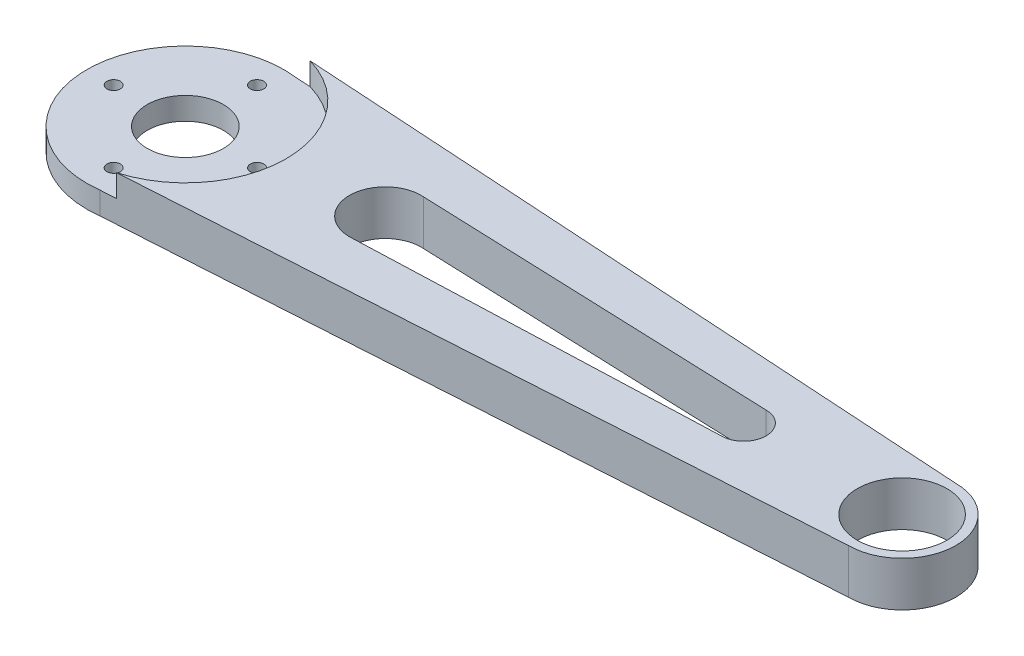
ISO-10303-21;
HEADER;
FILE_DESCRIPTION(('STEP AP214'),'2;1');
FILE_NAME('part.step','',(''),(''),'','','');
FILE_SCHEMA(('AUTOMOTIVE_DESIGN { 1 0 10303 214 1 1 1 1 }'));
ENDSEC;
DATA;
#1=APPLICATION_CONTEXT('core data for automotive mechanical design processes');
#2=APPLICATION_PROTOCOL_DEFINITION('international standard','automotive_design',2000,#1);
#3=PRODUCT_CONTEXT('',#1,'mechanical');
#4=PRODUCT('Part','Part','',(#3));
#5=PRODUCT_RELATED_PRODUCT_CATEGORY('part','',(#4));
#6=PRODUCT_DEFINITION_FORMATION('','',#4);
#7=PRODUCT_DEFINITION_CONTEXT('part definition',#1,'design');
#8=PRODUCT_DEFINITION('design','',#6,#7);
#9=PRODUCT_DEFINITION_SHAPE('','',#8);
#10=(LENGTH_UNIT() NAMED_UNIT(*) SI_UNIT(.MILLI.,.METRE.));
#11=(NAMED_UNIT(*) PLANE_ANGLE_UNIT() SI_UNIT($,.RADIAN.));
#12=(NAMED_UNIT(*) SI_UNIT($,.STERADIAN.) SOLID_ANGLE_UNIT());
#13=UNCERTAINTY_MEASURE_WITH_UNIT(LENGTH_MEASURE(1.E-05),#10,'distance_accuracy_value','');
#14=(GEOMETRIC_REPRESENTATION_CONTEXT(3) GLOBAL_UNCERTAINTY_ASSIGNED_CONTEXT((#13)) GLOBAL_UNIT_ASSIGNED_CONTEXT((#10,
#11,#12)) REPRESENTATION_CONTEXT('',''));
#15=CARTESIAN_POINT('',(0.,0.,0.));
#16=DIRECTION('',(0.,0.,1.));
#17=DIRECTION('',(1.,0.,0.));
#18=AXIS2_PLACEMENT_3D('',#15,#16,#17);
#19=CARTESIAN_POINT('',(-44.3187849693587,5.,0.));
#20=DIRECTION('',(0.,-1.,0.));
#21=DIRECTION('',(0.,0.,-1.));
#22=AXIS2_PLACEMENT_3D('',#19,#20,#21);
#23=CYLINDRICAL_SURFACE('',#22,11.);
#24=CARTESIAN_POINT('',(-44.3187849693587,2.5,0.));
#25=DIRECTION('',(0.,1.,0.));
#26=DIRECTION('',(0.,0.,1.));
#27=AXIS2_PLACEMENT_3D('',#24,#25,#26);
#28=CIRCLE('',#27,11.);
#29=CARTESIAN_POINT('',(-42.9491351639113,2.5,-10.9143968871595));
#30=VERTEX_POINT('',#29);
#31=CARTESIAN_POINT('',(-42.9491351639113,2.5,10.9143968871595));
#32=VERTEX_POINT('',#31);
#33=EDGE_CURVE('E150',#30,#32,#28,.T.);
#34=ORIENTED_EDGE('',*,*,#33,.F.);
#35=DIRECTION('',(0.,-1.,0.));
#36=VECTOR('',#35,1.);
#37=CARTESIAN_POINT('',(-42.9491351639113,5.,-10.9143968871595));
#38=LINE('',#37,#36);
#39=CARTESIAN_POINT('',(-42.9491351639113,0.,-10.9143968871595));
#40=VERTEX_POINT('',#39);
#41=EDGE_CURVE('E180',#40,#30,#38,.F.);
#42=ORIENTED_EDGE('',*,*,#41,.F.);
#43=CARTESIAN_POINT('',(-44.3187849693587,0.,0.));
#44=DIRECTION('',(0.,1.,0.));
#45=DIRECTION('',(0.,0.,1.));
#46=AXIS2_PLACEMENT_3D('',#43,#44,#45);
#47=CIRCLE('',#46,11.);
#48=CARTESIAN_POINT('',(-42.9491351639113,0.,10.9143968871595));
#49=VERTEX_POINT('',#48);
#50=EDGE_CURVE('E185',#40,#49,#47,.T.);
#51=ORIENTED_EDGE('',*,*,#50,.T.);
#52=DIRECTION('',(0.,-1.,0.));
#53=VECTOR('',#52,1.);
#54=CARTESIAN_POINT('',(-42.9491351639113,5.,10.9143968871595));
#55=LINE('',#54,#53);
#56=EDGE_CURVE('E183',#32,#49,#55,.T.);
#57=ORIENTED_EDGE('',*,*,#56,.F.);
#58=EDGE_LOOP('',(#34,#42,#51,#57));
#59=FACE_BOUND('',#58,.T.);
#60=ADVANCED_FACE('F37',(#59),#23,.T.);
#61=CARTESIAN_POINT('',(-44.3187849693587,5.,0.));
#62=DIRECTION('',(0.,1.,0.));
#63=DIRECTION('',(0.,0.,1.));
#64=AXIS2_PLACEMENT_3D('',#61,#62,#63);
#65=PLANE('',#64);
#66=DIRECTION('',(-0.999297615709181,0.,-0.0374736605890942));
#67=VECTOR('',#66,1.);
#68=CARTESIAN_POINT('',(-22.,5.,-4.));
#69=LINE('',#68,#67);
#70=CARTESIAN_POINT('',(18.,5.,-2.5));
#71=VERTEX_POINT('',#70);
#72=CARTESIAN_POINT('',(-21.7004212825714,5.,-3.98876579809643));
#73=VERTEX_POINT('',#72);
#74=EDGE_CURVE('E131',#71,#73,#69,.T.);
#75=ORIENTED_EDGE('',*,*,#74,.F.);
#76=CARTESIAN_POINT('',(18.,5.,0.));
#77=DIRECTION('',(0.,1.,0.));
#78=DIRECTION('',(0.,0.,1.));
#79=AXIS2_PLACEMENT_3D('',#76,#77,#78);
#80=CIRCLE('',#79,2.5);
#81=CARTESIAN_POINT('',(18.,5.,2.5));
#82=VERTEX_POINT('',#81);
#83=EDGE_CURVE('E135',#82,#71,#80,.T.);
#84=ORIENTED_EDGE('',*,*,#83,.F.);
#85=DIRECTION('',(0.999297615709181,0.,-0.0374736605890942));
#86=VECTOR('',#85,1.);
#87=CARTESIAN_POINT('',(18.,5.,2.5));
#88=LINE('',#87,#86);
#89=CARTESIAN_POINT('',(-21.7004212825714,5.,3.98876579809643));
#90=VERTEX_POINT('',#89);
#91=EDGE_CURVE('E115',#90,#82,#88,.T.);
#92=ORIENTED_EDGE('',*,*,#91,.F.);
#93=CARTESIAN_POINT('',(-22.,5.,0.));
#94=DIRECTION('',(0.,1.,0.));
#95=DIRECTION('',(0.,0.,1.));
#96=AXIS2_PLACEMENT_3D('',#93,#94,#95);
#97=CIRCLE('',#96,4.);
#98=EDGE_CURVE('E51',#73,#90,#97,.T.);
#99=ORIENTED_EDGE('',*,*,#98,.F.);
#100=EDGE_LOOP('',(#75,#84,#92,#99));
#101=FACE_BOUND('',#100,.T.);
#102=CARTESIAN_POINT('',(35.6812150306413,5.,0.));
#103=DIRECTION('',(0.,1.,0.));
#104=DIRECTION('',(0.,0.,1.));
#105=AXIS2_PLACEMENT_3D('',#102,#103,#104);
#106=CIRCLE('',#105,4.99999999999999);
#107=CARTESIAN_POINT('',(35.6812150306413,5.,4.99999999999999));
#108=VERTEX_POINT('',#107);
#109=EDGE_CURVE('E145',#108,#108,#106,.T.);
#110=ORIENTED_EDGE('',*,*,#109,.F.);
#111=EDGE_LOOP('',(#110));
#112=FACE_BOUND('',#111,.T.);
#113=CARTESIAN_POINT('',(-44.3187849693587,5.,0.));
#114=DIRECTION('',(0.,1.,0.));
#115=DIRECTION('',(0.,0.,1.));
#116=AXIS2_PLACEMENT_3D('',#113,#114,#115);
#117=CIRCLE('',#116,11.25);
#118=CARTESIAN_POINT('',(-41.1824623247394,5.,10.8039798347113));
#119=VERTEX_POINT('',#118);
#120=CARTESIAN_POINT('',(-41.1824623247394,5.,-10.8039798347113));
#121=VERTEX_POINT('',#120);
#122=EDGE_CURVE('E144',#119,#121,#117,.T.);
#123=ORIENTED_EDGE('',*,*,#122,.F.);
#124=DIRECTION('',(0.998052578482889,0.,-0.0623782861551804));
#125=VECTOR('',#124,1.);
#126=CARTESIAN_POINT('',(35.6812150306413,5.,6.));
#127=LINE('',#126,#125);
#128=CARTESIAN_POINT('',(35.6812150306413,5.,6.));
#129=VERTEX_POINT('',#128);
#130=EDGE_CURVE('E165',#119,#129,#127,.T.);
#131=ORIENTED_EDGE('',*,*,#130,.T.);
#132=CARTESIAN_POINT('',(35.6812150306413,5.,0.));
#133=DIRECTION('',(0.,1.,0.));
#134=DIRECTION('',(0.,0.,1.));
#135=AXIS2_PLACEMENT_3D('',#132,#133,#134);
#136=CIRCLE('',#135,6.);
#137=CARTESIAN_POINT('',(35.6812150306413,5.,-6.));
#138=VERTEX_POINT('',#137);
#139=EDGE_CURVE('E159',#129,#138,#136,.T.);
#140=ORIENTED_EDGE('',*,*,#139,.T.);
#141=DIRECTION('',(-0.998052578482889,0.,-0.0623782861551804));
#142=VECTOR('',#141,1.);
#143=CARTESIAN_POINT('',(-44.3187849693587,5.,-11.));
#144=LINE('',#143,#142);
#145=EDGE_CURVE('E167',#138,#121,#144,.T.);
#146=ORIENTED_EDGE('',*,*,#145,.T.);
#147=EDGE_LOOP('',(#123,#131,#140,#146));
#148=FACE_BOUND('',#147,.T.);
#149=ADVANCED_FACE('F195',(#101,#112,#148),#65,.T.);
#150=CARTESIAN_POINT('',(-44.3187849693587,0.,0.));
#151=DIRECTION('',(0.,1.,0.));
#152=DIRECTION('',(0.,0.,1.));
#153=AXIS2_PLACEMENT_3D('',#150,#151,#152);
#154=PLANE('',#153);
#155=CARTESIAN_POINT('',(-44.3187849693587,0.,0.));
#156=DIRECTION('',(0.,1.,0.));
#157=DIRECTION('',(0.,0.,1.));
#158=AXIS2_PLACEMENT_3D('',#155,#156,#157);
#159=CIRCLE('',#158,4.25000000000001);
#160=CARTESIAN_POINT('',(-44.3187849693587,0.,4.25000000000001));
#161=VERTEX_POINT('',#160);
#162=EDGE_CURVE('E277',#161,#161,#159,.T.);
#163=ORIENTED_EDGE('',*,*,#162,.T.);
#164=EDGE_LOOP('',(#163));
#165=FACE_BOUND('',#164,.T.);
#166=CARTESIAN_POINT('',(-44.3187849693587,0.,-8.));
#167=DIRECTION('',(0.,1.,0.));
#168=DIRECTION('',(0.,0.,1.));
#169=AXIS2_PLACEMENT_3D('',#166,#167,#168);
#170=CIRCLE('',#169,0.749999999999999);
#171=CARTESIAN_POINT('',(-44.3187849693587,0.,-7.25));
#172=VERTEX_POINT('',#171);
#173=EDGE_CURVE('E197',#172,#172,#170,.T.);
#174=ORIENTED_EDGE('',*,*,#173,.T.);
#175=EDGE_LOOP('',(#174));
#176=FACE_BOUND('',#175,.T.);
#177=CARTESIAN_POINT('',(-52.3187849693587,0.,0.));
#178=DIRECTION('',(0.,1.,0.));
#179=DIRECTION('',(0.,0.,1.));
#180=AXIS2_PLACEMENT_3D('',#177,#178,#179);
#181=CIRCLE('',#180,0.747737986683149);
#182=CARTESIAN_POINT('',(-52.3187849693587,0.,0.747737986683149));
#183=VERTEX_POINT('',#182);
#184=EDGE_CURVE('E283',#183,#183,#181,.T.);
#185=ORIENTED_EDGE('',*,*,#184,.T.);
#186=EDGE_LOOP('',(#185));
#187=FACE_BOUND('',#186,.T.);
#188=CARTESIAN_POINT('',(-44.3187849693587,0.,8.));
#189=DIRECTION('',(0.,1.,0.));
#190=DIRECTION('',(0.,0.,-1.));
#191=AXIS2_PLACEMENT_3D('',#188,#189,#190);
#192=CIRCLE('',#191,0.749999999999999);
#193=CARTESIAN_POINT('',(-44.3187849693587,0.,7.25));
#194=VERTEX_POINT('',#193);
#195=EDGE_CURVE('E287',#194,#194,#192,.T.);
#196=ORIENTED_EDGE('',*,*,#195,.T.);
#197=EDGE_LOOP('',(#196));
#198=FACE_BOUND('',#197,.T.);
#199=CARTESIAN_POINT('',(-36.3187849693587,0.,0.));
#200=DIRECTION('',(0.,1.,0.));
#201=DIRECTION('',(0.,0.,-1.));
#202=AXIS2_PLACEMENT_3D('',#199,#200,#201);
#203=CIRCLE('',#202,0.747737986683149);
#204=CARTESIAN_POINT('',(-36.3187849693587,0.,-0.747737986683149));
#205=VERTEX_POINT('',#204);
#206=EDGE_CURVE('E290',#205,#205,#203,.T.);
#207=ORIENTED_EDGE('',*,*,#206,.T.);
#208=EDGE_LOOP('',(#207));
#209=FACE_BOUND('',#208,.T.);
#210=CARTESIAN_POINT('',(18.,0.,0.));
#211=DIRECTION('',(0.,1.,0.));
#212=DIRECTION('',(0.,0.,1.));
#213=AXIS2_PLACEMENT_3D('',#210,#211,#212);
#214=CIRCLE('',#213,2.5);
#215=CARTESIAN_POINT('',(18.,0.,2.5));
#216=VERTEX_POINT('',#215);
#217=CARTESIAN_POINT('',(18.,0.,-2.5));
#218=VERTEX_POINT('',#217);
#219=EDGE_CURVE('E129',#216,#218,#214,.T.);
#220=ORIENTED_EDGE('',*,*,#219,.T.);
#221=DIRECTION('',(-0.999297615709181,0.,-0.0374736605890942));
#222=VECTOR('',#221,1.);
#223=CARTESIAN_POINT('',(-22.,0.,-4.));
#224=LINE('',#223,#222);
#225=CARTESIAN_POINT('',(-21.7004212825714,0.,-3.98876579809643));
#226=VERTEX_POINT('',#225);
#227=EDGE_CURVE('E121',#218,#226,#224,.T.);
#228=ORIENTED_EDGE('',*,*,#227,.T.);
#229=CARTESIAN_POINT('',(-22.,0.,0.));
#230=DIRECTION('',(0.,1.,0.));
#231=DIRECTION('',(0.,0.,1.));
#232=AXIS2_PLACEMENT_3D('',#229,#230,#231);
#233=CIRCLE('',#232,4.);
#234=CARTESIAN_POINT('',(-21.7004212825714,0.,3.98876579809643));
#235=VERTEX_POINT('',#234);
#236=EDGE_CURVE('E130',#226,#235,#233,.T.);
#237=ORIENTED_EDGE('',*,*,#236,.T.);
#238=DIRECTION('',(0.999297615709181,0.,-0.0374736605890942));
#239=VECTOR('',#238,1.);
#240=CARTESIAN_POINT('',(18.,0.,2.5));
#241=LINE('',#240,#239);
#242=EDGE_CURVE('E59',#235,#216,#241,.T.);
#243=ORIENTED_EDGE('',*,*,#242,.T.);
#244=EDGE_LOOP('',(#220,#228,#237,#243));
#245=FACE_BOUND('',#244,.T.);
#246=CARTESIAN_POINT('',(35.6812150306413,0.,0.));
#247=DIRECTION('',(0.,1.,0.));
#248=DIRECTION('',(0.,0.,1.));
#249=AXIS2_PLACEMENT_3D('',#246,#247,#248);
#250=CIRCLE('',#249,4.99999999999999);
#251=CARTESIAN_POINT('',(35.6812150306413,0.,4.99999999999999));
#252=VERTEX_POINT('',#251);
#253=EDGE_CURVE('E141',#252,#252,#250,.T.);
#254=ORIENTED_EDGE('',*,*,#253,.T.);
#255=EDGE_LOOP('',(#254));
#256=FACE_BOUND('',#255,.T.);
#257=DIRECTION('',(-0.998052578482889,0.,-0.0623782861551804));
#258=VECTOR('',#257,1.);
#259=CARTESIAN_POINT('',(-44.3187849693587,0.,-11.));
#260=LINE('',#259,#258);
#261=CARTESIAN_POINT('',(35.6812150306413,0.,-6.));
#262=VERTEX_POINT('',#261);
#263=EDGE_CURVE('E168',#262,#40,#260,.T.);
#264=ORIENTED_EDGE('',*,*,#263,.F.);
#265=CARTESIAN_POINT('',(35.6812150306413,0.,0.));
#266=DIRECTION('',(0.,1.,0.));
#267=DIRECTION('',(0.,0.,1.));
#268=AXIS2_PLACEMENT_3D('',#265,#266,#267);
#269=CIRCLE('',#268,6.);
#270=CARTESIAN_POINT('',(35.6812150306413,0.,6.));
#271=VERTEX_POINT('',#270);
#272=EDGE_CURVE('E158',#271,#262,#269,.T.);
#273=ORIENTED_EDGE('',*,*,#272,.F.);
#274=DIRECTION('',(0.998052578482889,0.,-0.0623782861551804));
#275=VECTOR('',#274,1.);
#276=CARTESIAN_POINT('',(35.6812150306413,0.,6.));
#277=LINE('',#276,#275);
#278=EDGE_CURVE('E162',#49,#271,#277,.T.);
#279=ORIENTED_EDGE('',*,*,#278,.F.);
#280=ORIENTED_EDGE('',*,*,#50,.F.);
#281=EDGE_LOOP('',(#264,#273,#279,#280));
#282=FACE_BOUND('',#281,.T.);
#283=ADVANCED_FACE('F126',(#165,#176,#187,#198,#209,#245,#256,#282),#154,.F.);
#284=CARTESIAN_POINT('',(35.6812150306413,5.,6.));
#285=DIRECTION('',(-0.0623782861551804,0.,-0.998052578482889));
#286=DIRECTION('',(-0.998052578482889,0.,0.0623782861551804));
#287=AXIS2_PLACEMENT_3D('',#284,#285,#286);
#288=PLANE('',#287);
#289=ORIENTED_EDGE('',*,*,#130,.F.);
#290=DIRECTION('',(0.,1.,0.));
#291=VECTOR('',#290,1.);
#292=CARTESIAN_POINT('',(-41.1824623247394,2.5,10.8039798347113));
#293=LINE('',#292,#291);
#294=CARTESIAN_POINT('',(-41.1824623247394,2.5,10.8039798347113));
#295=VERTEX_POINT('',#294);
#296=EDGE_CURVE('E155',#119,#295,#293,.F.);
#297=ORIENTED_EDGE('',*,*,#296,.T.);
#298=DIRECTION('',(0.998052578482889,0.,-0.0623782861551804));
#299=VECTOR('',#298,1.);
#300=CARTESIAN_POINT('',(35.6812150306413,2.5,6.));
#301=LINE('',#300,#299);
#302=EDGE_CURVE('E153',#32,#295,#301,.T.);
#303=ORIENTED_EDGE('',*,*,#302,.F.);
#304=ORIENTED_EDGE('',*,*,#56,.T.);
#305=ORIENTED_EDGE('',*,*,#278,.T.);
#306=DIRECTION('',(0.,-1.,0.));
#307=VECTOR('',#306,1.);
#308=CARTESIAN_POINT('',(35.6812150306413,5.,6.));
#309=LINE('',#308,#307);
#310=EDGE_CURVE('E177',#129,#271,#309,.T.);
#311=ORIENTED_EDGE('',*,*,#310,.F.);
#312=EDGE_LOOP('',(#289,#297,#303,#304,#305,#311));
#313=FACE_BOUND('',#312,.T.);
#314=ADVANCED_FACE('F239',(#313),#288,.F.);
#315=CARTESIAN_POINT('',(-44.3187849693587,5.,-11.));
#316=DIRECTION('',(-0.0623782861551804,0.,0.998052578482889));
#317=DIRECTION('',(0.998052578482889,0.,0.0623782861551804));
#318=AXIS2_PLACEMENT_3D('',#315,#316,#317);
#319=PLANE('',#318);
#320=DIRECTION('',(-0.998052578482889,0.,-0.0623782861551804));
#321=VECTOR('',#320,1.);
#322=CARTESIAN_POINT('',(-44.3187849693587,2.5,-11.));
#323=LINE('',#322,#321);
#324=CARTESIAN_POINT('',(-41.1824623247394,2.5,-10.8039798347113));
#325=VERTEX_POINT('',#324);
#326=EDGE_CURVE('E188',#325,#30,#323,.T.);
#327=ORIENTED_EDGE('',*,*,#326,.F.);
#328=DIRECTION('',(0.,1.,0.));
#329=VECTOR('',#328,1.);
#330=CARTESIAN_POINT('',(-41.1824623247394,2.5,-10.8039798347113));
#331=LINE('',#330,#329);
#332=EDGE_CURVE('E190',#325,#121,#331,.T.);
#333=ORIENTED_EDGE('',*,*,#332,.T.);
#334=ORIENTED_EDGE('',*,*,#145,.F.);
#335=DIRECTION('',(0.,-1.,0.));
#336=VECTOR('',#335,1.);
#337=CARTESIAN_POINT('',(35.6812150306413,5.,-6.));
#338=LINE('',#337,#336);
#339=EDGE_CURVE('E171',#138,#262,#338,.T.);
#340=ORIENTED_EDGE('',*,*,#339,.T.);
#341=ORIENTED_EDGE('',*,*,#263,.T.);
#342=ORIENTED_EDGE('',*,*,#41,.T.);
#343=EDGE_LOOP('',(#327,#333,#334,#340,#341,#342));
#344=FACE_BOUND('',#343,.T.);
#345=ADVANCED_FACE('F231',(#344),#319,.F.);
#346=CARTESIAN_POINT('',(35.6812150306413,5.,0.));
#347=DIRECTION('',(0.,-1.,0.));
#348=DIRECTION('',(0.,0.,-1.));
#349=AXIS2_PLACEMENT_3D('',#346,#347,#348);
#350=CYLINDRICAL_SURFACE('',#349,6.);
#351=ORIENTED_EDGE('',*,*,#272,.T.);
#352=ORIENTED_EDGE('',*,*,#339,.F.);
#353=ORIENTED_EDGE('',*,*,#139,.F.);
#354=ORIENTED_EDGE('',*,*,#310,.T.);
#355=EDGE_LOOP('',(#351,#352,#353,#354));
#356=FACE_BOUND('',#355,.T.);
#357=ADVANCED_FACE('F242',(#356),#350,.T.);
#358=CARTESIAN_POINT('',(-44.3187849693587,2.5,0.));
#359=DIRECTION('',(0.,1.,0.));
#360=DIRECTION('',(0.,0.,1.));
#361=AXIS2_PLACEMENT_3D('',#358,#359,#360);
#362=CYLINDRICAL_SURFACE('',#361,11.25);
#363=ORIENTED_EDGE('',*,*,#122,.T.);
#364=ORIENTED_EDGE('',*,*,#332,.F.);
#365=CARTESIAN_POINT('',(-44.3187849693587,2.5,0.));
#366=DIRECTION('',(0.,1.,0.));
#367=DIRECTION('',(0.,0.,1.));
#368=AXIS2_PLACEMENT_3D('',#365,#366,#367);
#369=CIRCLE('',#368,11.25);
#370=EDGE_CURVE('E148',#295,#325,#369,.T.);
#371=ORIENTED_EDGE('',*,*,#370,.F.);
#372=ORIENTED_EDGE('',*,*,#296,.F.);
#373=EDGE_LOOP('',(#363,#364,#371,#372));
#374=FACE_BOUND('',#373,.T.);
#375=ADVANCED_FACE('F247',(#374),#362,.F.);
#376=CARTESIAN_POINT('',(-44.3187849693587,2.5,0.));
#377=DIRECTION('',(0.,1.,0.));
#378=DIRECTION('',(0.,0.,1.));
#379=AXIS2_PLACEMENT_3D('',#376,#377,#378);
#380=PLANE('',#379);
#381=CARTESIAN_POINT('',(-44.3187849693587,2.5,0.));
#382=DIRECTION('',(0.,1.,0.));
#383=DIRECTION('',(0.,0.,1.));
#384=AXIS2_PLACEMENT_3D('',#381,#382,#383);
#385=CIRCLE('',#384,4.25000000000001);
#386=CARTESIAN_POINT('',(-44.3187849693587,2.5,4.25000000000001));
#387=VERTEX_POINT('',#386);
#388=EDGE_CURVE('E306',#387,#387,#385,.T.);
#389=ORIENTED_EDGE('',*,*,#388,.F.);
#390=EDGE_LOOP('',(#389));
#391=FACE_BOUND('',#390,.T.);
#392=CARTESIAN_POINT('',(-44.3187849693587,2.5,-8.));
#393=DIRECTION('',(0.,1.,0.));
#394=DIRECTION('',(0.,0.,1.));
#395=AXIS2_PLACEMENT_3D('',#392,#393,#394);
#396=CIRCLE('',#395,0.749999999999999);
#397=CARTESIAN_POINT('',(-44.3187849693587,2.5,-7.25));
#398=VERTEX_POINT('',#397);
#399=EDGE_CURVE('E201',#398,#398,#396,.T.);
#400=ORIENTED_EDGE('',*,*,#399,.F.);
#401=EDGE_LOOP('',(#400));
#402=FACE_BOUND('',#401,.T.);
#403=CARTESIAN_POINT('',(-52.3187849693587,2.5,0.));
#404=DIRECTION('',(0.,1.,0.));
#405=DIRECTION('',(0.,0.,1.));
#406=AXIS2_PLACEMENT_3D('',#403,#404,#405);
#407=CIRCLE('',#406,0.747737986683149);
#408=CARTESIAN_POINT('',(-52.3187849693587,2.5,0.747737986683149));
#409=VERTEX_POINT('',#408);
#410=EDGE_CURVE('E300',#409,#409,#407,.T.);
#411=ORIENTED_EDGE('',*,*,#410,.F.);
#412=EDGE_LOOP('',(#411));
#413=FACE_BOUND('',#412,.T.);
#414=CARTESIAN_POINT('',(-44.3187849693587,2.5,8.));
#415=DIRECTION('',(0.,1.,0.));
#416=DIRECTION('',(0.,0.,-1.));
#417=AXIS2_PLACEMENT_3D('',#414,#415,#416);
#418=CIRCLE('',#417,0.749999999999999);
#419=CARTESIAN_POINT('',(-44.3187849693587,2.5,7.25));
#420=VERTEX_POINT('',#419);
#421=EDGE_CURVE('E291',#420,#420,#418,.T.);
#422=ORIENTED_EDGE('',*,*,#421,.F.);
#423=EDGE_LOOP('',(#422));
#424=FACE_BOUND('',#423,.T.);
#425=CARTESIAN_POINT('',(-36.3187849693587,2.5,0.));
#426=DIRECTION('',(0.,1.,0.));
#427=DIRECTION('',(0.,0.,-1.));
#428=AXIS2_PLACEMENT_3D('',#425,#426,#427);
#429=CIRCLE('',#428,0.747737986683149);
#430=CARTESIAN_POINT('',(-36.3187849693587,2.5,-0.747737986683149));
#431=VERTEX_POINT('',#430);
#432=EDGE_CURVE('E292',#431,#431,#429,.T.);
#433=ORIENTED_EDGE('',*,*,#432,.F.);
#434=EDGE_LOOP('',(#433));
#435=FACE_BOUND('',#434,.T.);
#436=ORIENTED_EDGE('',*,*,#302,.T.);
#437=ORIENTED_EDGE('',*,*,#370,.T.);
#438=ORIENTED_EDGE('',*,*,#326,.T.);
#439=ORIENTED_EDGE('',*,*,#33,.T.);
#440=EDGE_LOOP('',(#436,#437,#438,#439));
#441=FACE_BOUND('',#440,.T.);
#442=ADVANCED_FACE('F249',(#391,#402,#413,#424,#435,#441),#380,.T.);
#443=CARTESIAN_POINT('',(35.6812150306413,0.,0.));
#444=DIRECTION('',(0.,1.,0.));
#445=DIRECTION('',(0.,0.,1.));
#446=AXIS2_PLACEMENT_3D('',#443,#444,#445);
#447=CYLINDRICAL_SURFACE('',#446,4.99999999999999);
#448=ORIENTED_EDGE('',*,*,#253,.F.);
#449=EDGE_LOOP('',(#448));
#450=FACE_BOUND('',#449,.T.);
#451=ORIENTED_EDGE('',*,*,#109,.T.);
#452=EDGE_LOOP('',(#451));
#453=FACE_BOUND('',#452,.T.);
#454=ADVANCED_FACE('F251',(#450,#453),#447,.F.);
#455=CARTESIAN_POINT('',(18.,0.,0.));
#456=DIRECTION('',(0.,1.,0.));
#457=DIRECTION('',(0.,0.,1.));
#458=AXIS2_PLACEMENT_3D('',#455,#456,#457);
#459=CYLINDRICAL_SURFACE('',#458,2.5);
#460=ORIENTED_EDGE('',*,*,#83,.T.);
#461=DIRECTION('',(0.,1.,0.));
#462=VECTOR('',#461,1.);
#463=CARTESIAN_POINT('',(18.,0.,-2.5));
#464=LINE('',#463,#462);
#465=EDGE_CURVE('E120',#218,#71,#464,.T.);
#466=ORIENTED_EDGE('',*,*,#465,.F.);
#467=ORIENTED_EDGE('',*,*,#219,.F.);
#468=DIRECTION('',(0.,1.,0.));
#469=VECTOR('',#468,1.);
#470=CARTESIAN_POINT('',(18.,0.,2.5));
#471=LINE('',#470,#469);
#472=EDGE_CURVE('E113',#216,#82,#471,.T.);
#473=ORIENTED_EDGE('',*,*,#472,.T.);
#474=EDGE_LOOP('',(#460,#466,#467,#473));
#475=FACE_BOUND('',#474,.T.);
#476=ADVANCED_FACE('F134',(#475),#459,.F.);
#477=CARTESIAN_POINT('',(-22.,0.,0.));
#478=DIRECTION('',(0.,1.,0.));
#479=DIRECTION('',(0.,0.,1.));
#480=AXIS2_PLACEMENT_3D('',#477,#478,#479);
#481=CYLINDRICAL_SURFACE('',#480,4.);
#482=ORIENTED_EDGE('',*,*,#98,.T.);
#483=DIRECTION('',(0.,1.,0.));
#484=VECTOR('',#483,1.);
#485=CARTESIAN_POINT('',(-21.7004212825714,0.,3.98876579809643));
#486=LINE('',#485,#484);
#487=EDGE_CURVE('E44',#90,#235,#486,.F.);
#488=ORIENTED_EDGE('',*,*,#487,.T.);
#489=ORIENTED_EDGE('',*,*,#236,.F.);
#490=DIRECTION('',(0.,1.,0.));
#491=VECTOR('',#490,1.);
#492=CARTESIAN_POINT('',(-21.7004212825714,0.,-3.98876579809643));
#493=LINE('',#492,#491);
#494=EDGE_CURVE('E11',#226,#73,#493,.T.);
#495=ORIENTED_EDGE('',*,*,#494,.T.);
#496=EDGE_LOOP('',(#482,#488,#489,#495));
#497=FACE_BOUND('',#496,.T.);
#498=ADVANCED_FACE('F193',(#497),#481,.F.);
#499=CARTESIAN_POINT('',(18.,0.,2.5));
#500=DIRECTION('',(0.0374736605890942,0.,0.999297615709181));
#501=DIRECTION('',(0.999297615709181,0.,-0.0374736605890942));
#502=AXIS2_PLACEMENT_3D('',#499,#500,#501);
#503=PLANE('',#502);
#504=ORIENTED_EDGE('',*,*,#91,.T.);
#505=ORIENTED_EDGE('',*,*,#472,.F.);
#506=ORIENTED_EDGE('',*,*,#242,.F.);
#507=ORIENTED_EDGE('',*,*,#487,.F.);
#508=EDGE_LOOP('',(#504,#505,#506,#507));
#509=FACE_BOUND('',#508,.T.);
#510=ADVANCED_FACE('F114',(#509),#503,.F.);
#511=CARTESIAN_POINT('',(-22.,0.,-4.));
#512=DIRECTION('',(0.0374736605890942,0.,-0.999297615709181));
#513=DIRECTION('',(-0.999297615709181,0.,-0.0374736605890942));
#514=AXIS2_PLACEMENT_3D('',#511,#512,#513);
#515=PLANE('',#514);
#516=ORIENTED_EDGE('',*,*,#227,.F.);
#517=ORIENTED_EDGE('',*,*,#465,.T.);
#518=ORIENTED_EDGE('',*,*,#74,.T.);
#519=ORIENTED_EDGE('',*,*,#494,.F.);
#520=EDGE_LOOP('',(#516,#517,#518,#519));
#521=FACE_BOUND('',#520,.T.);
#522=ADVANCED_FACE('F206',(#521),#515,.F.);
#523=CARTESIAN_POINT('',(-36.3187849693587,0.,0.));
#524=DIRECTION('',(0.,1.,0.));
#525=DIRECTION('',(0.,0.,1.));
#526=AXIS2_PLACEMENT_3D('',#523,#524,#525);
#527=CYLINDRICAL_SURFACE('',#526,0.747737986683149);
#528=ORIENTED_EDGE('',*,*,#206,.F.);
#529=EDGE_LOOP('',(#528));
#530=FACE_BOUND('',#529,.T.);
#531=ORIENTED_EDGE('',*,*,#432,.T.);
#532=EDGE_LOOP('',(#531));
#533=FACE_BOUND('',#532,.T.);
#534=ADVANCED_FACE('F208',(#530,#533),#527,.F.);
#535=CARTESIAN_POINT('',(-44.3187849693587,0.,8.));
#536=DIRECTION('',(0.,1.,0.));
#537=DIRECTION('',(0.,0.,1.));
#538=AXIS2_PLACEMENT_3D('',#535,#536,#537);
#539=CYLINDRICAL_SURFACE('',#538,0.749999999999999);
#540=ORIENTED_EDGE('',*,*,#195,.F.);
#541=EDGE_LOOP('',(#540));
#542=FACE_BOUND('',#541,.T.);
#543=ORIENTED_EDGE('',*,*,#421,.T.);
#544=EDGE_LOOP('',(#543));
#545=FACE_BOUND('',#544,.T.);
#546=ADVANCED_FACE('F214',(#542,#545),#539,.F.);
#547=CARTESIAN_POINT('',(-52.3187849693587,0.,0.));
#548=DIRECTION('',(0.,1.,0.));
#549=DIRECTION('',(0.,0.,1.));
#550=AXIS2_PLACEMENT_3D('',#547,#548,#549);
#551=CYLINDRICAL_SURFACE('',#550,0.747737986683149);
#552=ORIENTED_EDGE('',*,*,#184,.F.);
#553=EDGE_LOOP('',(#552));
#554=FACE_BOUND('',#553,.T.);
#555=ORIENTED_EDGE('',*,*,#410,.T.);
#556=EDGE_LOOP('',(#555));
#557=FACE_BOUND('',#556,.T.);
#558=ADVANCED_FACE('F318',(#554,#557),#551,.F.);
#559=CARTESIAN_POINT('',(-44.3187849693587,0.,-8.));
#560=DIRECTION('',(0.,1.,0.));
#561=DIRECTION('',(0.,0.,1.));
#562=AXIS2_PLACEMENT_3D('',#559,#560,#561);
#563=CYLINDRICAL_SURFACE('',#562,0.749999999999999);
#564=ORIENTED_EDGE('',*,*,#173,.F.);
#565=EDGE_LOOP('',(#564));
#566=FACE_BOUND('',#565,.T.);
#567=ORIENTED_EDGE('',*,*,#399,.T.);
#568=EDGE_LOOP('',(#567));
#569=FACE_BOUND('',#568,.T.);
#570=ADVANCED_FACE('F312',(#566,#569),#563,.F.);
#571=CARTESIAN_POINT('',(-44.3187849693587,0.,0.));
#572=DIRECTION('',(0.,1.,0.));
#573=DIRECTION('',(0.,0.,1.));
#574=AXIS2_PLACEMENT_3D('',#571,#572,#573);
#575=CYLINDRICAL_SURFACE('',#574,4.25000000000001);
#576=ORIENTED_EDGE('',*,*,#162,.F.);
#577=EDGE_LOOP('',(#576));
#578=FACE_BOUND('',#577,.T.);
#579=ORIENTED_EDGE('',*,*,#388,.T.);
#580=EDGE_LOOP('',(#579));
#581=FACE_BOUND('',#580,.T.);
#582=ADVANCED_FACE('F310',(#578,#581),#575,.F.);
#583=CLOSED_SHELL('',(#60,#149,#283,#314,#345,#357,#375,#442,#454,#476,#498,#510,#522,#534,#546,
#558,#570,#582));
#584=MANIFOLD_SOLID_BREP('B2',#583);
#585=ADVANCED_BREP_SHAPE_REPRESENTATION('',(#18,#584),#14);
#586=SHAPE_DEFINITION_REPRESENTATION(#9,#585);
ENDSEC;
END-ISO-10303-21;
